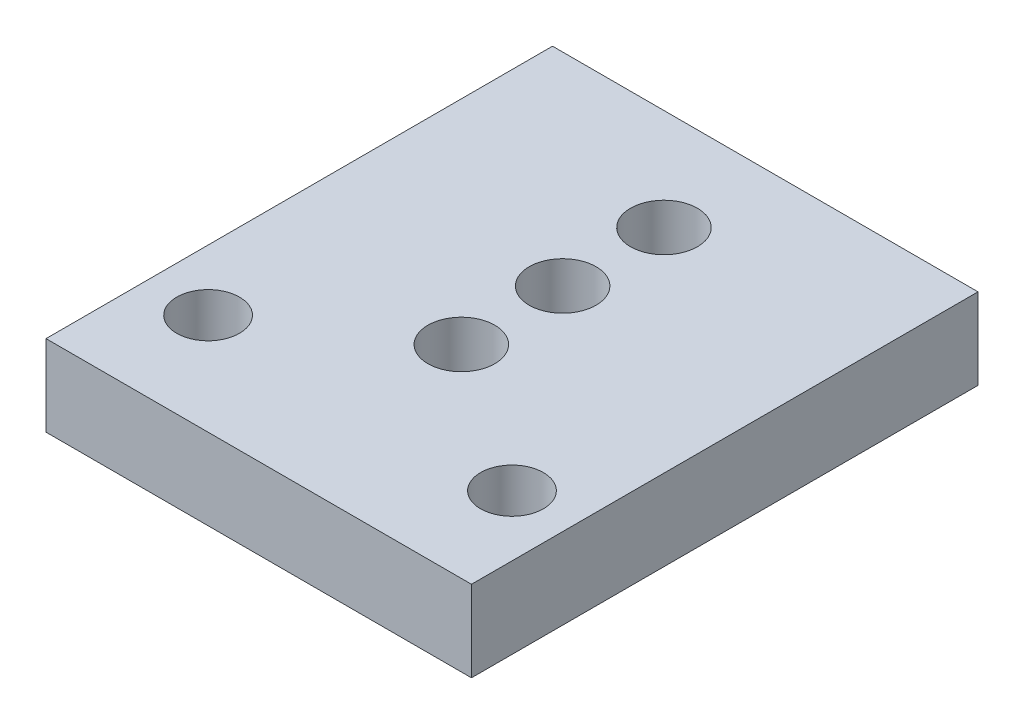
ISO-10303-21;
HEADER;
FILE_DESCRIPTION(('STEP AP214'),'2;1');
FILE_NAME('part.step','',(''),(''),'','','');
FILE_SCHEMA(('AUTOMOTIVE_DESIGN { 1 0 10303 214 1 1 1 1 }'));
ENDSEC;
DATA;
#1=APPLICATION_CONTEXT('core data for automotive mechanical design processes');
#2=APPLICATION_PROTOCOL_DEFINITION('international standard','automotive_design',2000,#1);
#3=PRODUCT_CONTEXT('',#1,'mechanical');
#4=PRODUCT('Part','Part','',(#3));
#5=PRODUCT_RELATED_PRODUCT_CATEGORY('part','',(#4));
#6=PRODUCT_DEFINITION_FORMATION('','',#4);
#7=PRODUCT_DEFINITION_CONTEXT('part definition',#1,'design');
#8=PRODUCT_DEFINITION('design','',#6,#7);
#9=PRODUCT_DEFINITION_SHAPE('','',#8);
#10=(LENGTH_UNIT() NAMED_UNIT(*) SI_UNIT(.MILLI.,.METRE.));
#11=(NAMED_UNIT(*) PLANE_ANGLE_UNIT() SI_UNIT($,.RADIAN.));
#12=(NAMED_UNIT(*) SI_UNIT($,.STERADIAN.) SOLID_ANGLE_UNIT());
#13=UNCERTAINTY_MEASURE_WITH_UNIT(LENGTH_MEASURE(1.E-05),#10,'distance_accuracy_value','');
#14=(GEOMETRIC_REPRESENTATION_CONTEXT(3) GLOBAL_UNCERTAINTY_ASSIGNED_CONTEXT((#13)) GLOBAL_UNIT_ASSIGNED_CONTEXT((#10,
#11,#12)) REPRESENTATION_CONTEXT('',''));
#15=CARTESIAN_POINT('',(0.,0.,0.));
#16=DIRECTION('',(0.,0.,1.));
#17=DIRECTION('',(1.,0.,0.));
#18=AXIS2_PLACEMENT_3D('',#15,#16,#17);
#19=CARTESIAN_POINT('',(0.,4.,0.));
#20=DIRECTION('',(1.,0.,0.));
#21=DIRECTION('',(0.,0.,-1.));
#22=AXIS2_PLACEMENT_3D('',#19,#20,#21);
#23=PLANE('',#22);
#24=DIRECTION('',(0.,0.,1.));
#25=VECTOR('',#24,1.);
#26=CARTESIAN_POINT('',(0.,0.,0.));
#27=LINE('',#26,#25);
#28=CARTESIAN_POINT('',(0.,0.,-25.));
#29=VERTEX_POINT('',#28);
#30=CARTESIAN_POINT('',(0.,0.,0.));
#31=VERTEX_POINT('',#30);
#32=EDGE_CURVE('E104',#29,#31,#27,.T.);
#33=ORIENTED_EDGE('',*,*,#32,.T.);
#34=DIRECTION('',(0.,-1.,0.));
#35=VECTOR('',#34,1.);
#36=CARTESIAN_POINT('',(0.,4.,0.));
#37=LINE('',#36,#35);
#38=CARTESIAN_POINT('',(0.,4.,0.));
#39=VERTEX_POINT('',#38);
#40=EDGE_CURVE('E11',#39,#31,#37,.T.);
#41=ORIENTED_EDGE('',*,*,#40,.F.);
#42=DIRECTION('',(0.,0.,1.));
#43=VECTOR('',#42,1.);
#44=CARTESIAN_POINT('',(0.,4.,0.));
#45=LINE('',#44,#43);
#46=CARTESIAN_POINT('',(0.,4.,-25.));
#47=VERTEX_POINT('',#46);
#48=EDGE_CURVE('E91',#47,#39,#45,.T.);
#49=ORIENTED_EDGE('',*,*,#48,.F.);
#50=DIRECTION('',(0.,-1.,0.));
#51=VECTOR('',#50,1.);
#52=CARTESIAN_POINT('',(0.,4.,-25.));
#53=LINE('',#52,#51);
#54=EDGE_CURVE('E100',#47,#29,#53,.T.);
#55=ORIENTED_EDGE('',*,*,#54,.T.);
#56=EDGE_LOOP('',(#33,#41,#49,#55));
#57=FACE_BOUND('',#56,.T.);
#58=ADVANCED_FACE('F38',(#57),#23,.F.);
#59=CARTESIAN_POINT('',(0.,4.,0.));
#60=DIRECTION('',(0.,0.,-1.));
#61=DIRECTION('',(-1.,0.,0.));
#62=AXIS2_PLACEMENT_3D('',#59,#60,#61);
#63=PLANE('',#62);
#64=DIRECTION('',(1.,0.,0.));
#65=VECTOR('',#64,1.);
#66=CARTESIAN_POINT('',(0.,0.,0.));
#67=LINE('',#66,#65);
#68=CARTESIAN_POINT('',(21.,0.,0.));
#69=VERTEX_POINT('',#68);
#70=EDGE_CURVE('E95',#31,#69,#67,.T.);
#71=ORIENTED_EDGE('',*,*,#70,.T.);
#72=DIRECTION('',(0.,-1.,0.));
#73=VECTOR('',#72,1.);
#74=CARTESIAN_POINT('',(21.,4.,0.));
#75=LINE('',#74,#73);
#76=CARTESIAN_POINT('',(21.,4.,0.));
#77=VERTEX_POINT('',#76);
#78=EDGE_CURVE('E47',#77,#69,#75,.T.);
#79=ORIENTED_EDGE('',*,*,#78,.F.);
#80=DIRECTION('',(1.,0.,0.));
#81=VECTOR('',#80,1.);
#82=CARTESIAN_POINT('',(0.,4.,0.));
#83=LINE('',#82,#81);
#84=EDGE_CURVE('E86',#39,#77,#83,.T.);
#85=ORIENTED_EDGE('',*,*,#84,.F.);
#86=ORIENTED_EDGE('',*,*,#40,.T.);
#87=EDGE_LOOP('',(#71,#79,#85,#86));
#88=FACE_BOUND('',#87,.T.);
#89=ADVANCED_FACE('F94',(#88),#63,.F.);
#90=CARTESIAN_POINT('',(21.,4.,0.));
#91=DIRECTION('',(-1.,0.,0.));
#92=DIRECTION('',(0.,0.,1.));
#93=AXIS2_PLACEMENT_3D('',#90,#91,#92);
#94=PLANE('',#93);
#95=DIRECTION('',(0.,0.,-1.));
#96=VECTOR('',#95,1.);
#97=CARTESIAN_POINT('',(21.,0.,0.));
#98=LINE('',#97,#96);
#99=CARTESIAN_POINT('',(21.,0.,-25.));
#100=VERTEX_POINT('',#99);
#101=EDGE_CURVE('E73',#69,#100,#98,.T.);
#102=ORIENTED_EDGE('',*,*,#101,.T.);
#103=DIRECTION('',(0.,-1.,0.));
#104=VECTOR('',#103,1.);
#105=CARTESIAN_POINT('',(21.,4.,-25.));
#106=LINE('',#105,#104);
#107=CARTESIAN_POINT('',(21.,4.,-25.));
#108=VERTEX_POINT('',#107);
#109=EDGE_CURVE('E96',#108,#100,#106,.T.);
#110=ORIENTED_EDGE('',*,*,#109,.F.);
#111=DIRECTION('',(0.,0.,-1.));
#112=VECTOR('',#111,1.);
#113=CARTESIAN_POINT('',(21.,4.,0.));
#114=LINE('',#113,#112);
#115=EDGE_CURVE('E89',#77,#108,#114,.T.);
#116=ORIENTED_EDGE('',*,*,#115,.F.);
#117=ORIENTED_EDGE('',*,*,#78,.T.);
#118=EDGE_LOOP('',(#102,#110,#116,#117));
#119=FACE_BOUND('',#118,.T.);
#120=ADVANCED_FACE('F98',(#119),#94,.F.);
#121=CARTESIAN_POINT('',(0.,4.,-25.));
#122=DIRECTION('',(0.,0.,1.));
#123=DIRECTION('',(1.,0.,0.));
#124=AXIS2_PLACEMENT_3D('',#121,#122,#123);
#125=PLANE('',#124);
#126=DIRECTION('',(-1.,0.,0.));
#127=VECTOR('',#126,1.);
#128=CARTESIAN_POINT('',(0.,0.,-25.));
#129=LINE('',#128,#127);
#130=EDGE_CURVE('E79',#100,#29,#129,.T.);
#131=ORIENTED_EDGE('',*,*,#130,.T.);
#132=ORIENTED_EDGE('',*,*,#54,.F.);
#133=DIRECTION('',(-1.,0.,0.));
#134=VECTOR('',#133,1.);
#135=CARTESIAN_POINT('',(0.,4.,-25.));
#136=LINE('',#135,#134);
#137=EDGE_CURVE('E56',#108,#47,#136,.T.);
#138=ORIENTED_EDGE('',*,*,#137,.F.);
#139=ORIENTED_EDGE('',*,*,#109,.T.);
#140=EDGE_LOOP('',(#131,#132,#138,#139));
#141=FACE_BOUND('',#140,.T.);
#142=ADVANCED_FACE('F149',(#141),#125,.F.);
#143=CARTESIAN_POINT('',(0.,4.,0.));
#144=DIRECTION('',(0.,-1.,0.));
#145=DIRECTION('',(0.,0.,-1.));
#146=AXIS2_PLACEMENT_3D('',#143,#144,#145);
#147=PLANE('',#146);
#148=CARTESIAN_POINT('',(10.5,4.,-20.));
#149=DIRECTION('',(0.,1.,0.));
#150=DIRECTION('',(0.,0.,1.));
#151=AXIS2_PLACEMENT_3D('',#148,#149,#150);
#152=CIRCLE('',#151,1.65);
#153=CARTESIAN_POINT('',(10.5,4.,-18.35));
#154=VERTEX_POINT('',#153);
#155=EDGE_CURVE('E140',#154,#154,#152,.T.);
#156=ORIENTED_EDGE('',*,*,#155,.F.);
#157=EDGE_LOOP('',(#156));
#158=FACE_BOUND('',#157,.T.);
#159=CARTESIAN_POINT('',(10.5,4.,-15.));
#160=DIRECTION('',(0.,1.,0.));
#161=DIRECTION('',(0.,0.,1.));
#162=AXIS2_PLACEMENT_3D('',#159,#160,#161);
#163=CIRCLE('',#162,1.65);
#164=CARTESIAN_POINT('',(10.5,4.,-13.35));
#165=VERTEX_POINT('',#164);
#166=EDGE_CURVE('E134',#165,#165,#163,.T.);
#167=ORIENTED_EDGE('',*,*,#166,.F.);
#168=EDGE_LOOP('',(#167));
#169=FACE_BOUND('',#168,.T.);
#170=CARTESIAN_POINT('',(10.5,4.,-10.));
#171=DIRECTION('',(0.,1.,0.));
#172=DIRECTION('',(0.,0.,1.));
#173=AXIS2_PLACEMENT_3D('',#170,#171,#172);
#174=CIRCLE('',#173,1.65);
#175=CARTESIAN_POINT('',(10.5,4.,-8.35));
#176=VERTEX_POINT('',#175);
#177=EDGE_CURVE('E128',#176,#176,#174,.T.);
#178=ORIENTED_EDGE('',*,*,#177,.F.);
#179=EDGE_LOOP('',(#178));
#180=FACE_BOUND('',#179,.T.);
#181=CARTESIAN_POINT('',(3.,4.,-5.));
#182=DIRECTION('',(0.,1.,0.));
#183=DIRECTION('',(0.,0.,1.));
#184=AXIS2_PLACEMENT_3D('',#181,#182,#183);
#185=CIRCLE('',#184,1.55);
#186=CARTESIAN_POINT('',(3.,4.,-3.45));
#187=VERTEX_POINT('',#186);
#188=EDGE_CURVE('E121',#187,#187,#185,.T.);
#189=ORIENTED_EDGE('',*,*,#188,.F.);
#190=EDGE_LOOP('',(#189));
#191=FACE_BOUND('',#190,.T.);
#192=CARTESIAN_POINT('',(18.,4.,-5.));
#193=DIRECTION('',(0.,1.,0.));
#194=DIRECTION('',(0.,0.,1.));
#195=AXIS2_PLACEMENT_3D('',#192,#193,#194);
#196=CIRCLE('',#195,1.55);
#197=CARTESIAN_POINT('',(18.,4.,-3.45));
#198=VERTEX_POINT('',#197);
#199=EDGE_CURVE('E113',#198,#198,#196,.T.);
#200=ORIENTED_EDGE('',*,*,#199,.F.);
#201=EDGE_LOOP('',(#200));
#202=FACE_BOUND('',#201,.T.);
#203=ORIENTED_EDGE('',*,*,#48,.T.);
#204=ORIENTED_EDGE('',*,*,#84,.T.);
#205=ORIENTED_EDGE('',*,*,#115,.T.);
#206=ORIENTED_EDGE('',*,*,#137,.T.);
#207=EDGE_LOOP('',(#203,#204,#205,#206));
#208=FACE_BOUND('',#207,.T.);
#209=ADVANCED_FACE('F87',(#158,#169,#180,#191,#202,#208),#147,.F.);
#210=CARTESIAN_POINT('',(0.,0.,0.));
#211=DIRECTION('',(0.,-1.,0.));
#212=DIRECTION('',(0.,0.,-1.));
#213=AXIS2_PLACEMENT_3D('',#210,#211,#212);
#214=PLANE('',#213);
#215=CARTESIAN_POINT('',(10.5,0.,-20.));
#216=DIRECTION('',(0.,1.,0.));
#217=DIRECTION('',(0.,0.,1.));
#218=AXIS2_PLACEMENT_3D('',#215,#216,#217);
#219=CIRCLE('',#218,1.65);
#220=CARTESIAN_POINT('',(10.5,0.,-18.35));
#221=VERTEX_POINT('',#220);
#222=EDGE_CURVE('E137',#221,#221,#219,.T.);
#223=ORIENTED_EDGE('',*,*,#222,.T.);
#224=EDGE_LOOP('',(#223));
#225=FACE_BOUND('',#224,.T.);
#226=CARTESIAN_POINT('',(10.5,0.,-15.));
#227=DIRECTION('',(0.,1.,0.));
#228=DIRECTION('',(0.,0.,1.));
#229=AXIS2_PLACEMENT_3D('',#226,#227,#228);
#230=CIRCLE('',#229,1.65);
#231=CARTESIAN_POINT('',(10.5,0.,-13.35));
#232=VERTEX_POINT('',#231);
#233=EDGE_CURVE('E131',#232,#232,#230,.T.);
#234=ORIENTED_EDGE('',*,*,#233,.T.);
#235=EDGE_LOOP('',(#234));
#236=FACE_BOUND('',#235,.T.);
#237=CARTESIAN_POINT('',(10.5,0.,-10.));
#238=DIRECTION('',(0.,1.,0.));
#239=DIRECTION('',(0.,0.,1.));
#240=AXIS2_PLACEMENT_3D('',#237,#238,#239);
#241=CIRCLE('',#240,1.65);
#242=CARTESIAN_POINT('',(10.5,0.,-8.35));
#243=VERTEX_POINT('',#242);
#244=EDGE_CURVE('E125',#243,#243,#241,.T.);
#245=ORIENTED_EDGE('',*,*,#244,.T.);
#246=EDGE_LOOP('',(#245));
#247=FACE_BOUND('',#246,.T.);
#248=CARTESIAN_POINT('',(3.,0.,-5.));
#249=DIRECTION('',(0.,-1.,0.));
#250=DIRECTION('',(0.,0.,-1.));
#251=AXIS2_PLACEMENT_3D('',#248,#249,#250);
#252=CIRCLE('',#251,1.55);
#253=CARTESIAN_POINT('',(3.,0.,-6.55));
#254=VERTEX_POINT('',#253);
#255=EDGE_CURVE('E41',#254,#254,#252,.T.);
#256=ORIENTED_EDGE('',*,*,#255,.F.);
#257=EDGE_LOOP('',(#256));
#258=FACE_BOUND('',#257,.T.);
#259=CARTESIAN_POINT('',(18.,0.,-5.));
#260=DIRECTION('',(0.,-1.,0.));
#261=DIRECTION('',(0.,0.,-1.));
#262=AXIS2_PLACEMENT_3D('',#259,#260,#261);
#263=CIRCLE('',#262,1.55);
#264=CARTESIAN_POINT('',(18.,0.,-6.55));
#265=VERTEX_POINT('',#264);
#266=EDGE_CURVE('E107',#265,#265,#263,.T.);
#267=ORIENTED_EDGE('',*,*,#266,.F.);
#268=EDGE_LOOP('',(#267));
#269=FACE_BOUND('',#268,.T.);
#270=ORIENTED_EDGE('',*,*,#32,.F.);
#271=ORIENTED_EDGE('',*,*,#130,.F.);
#272=ORIENTED_EDGE('',*,*,#101,.F.);
#273=ORIENTED_EDGE('',*,*,#70,.F.);
#274=EDGE_LOOP('',(#270,#271,#272,#273));
#275=FACE_BOUND('',#274,.T.);
#276=ADVANCED_FACE('F148',(#225,#236,#247,#258,#269,#275),#214,.T.);
#277=CARTESIAN_POINT('',(18.,4.,-5.));
#278=DIRECTION('',(0.,1.,0.));
#279=DIRECTION('',(0.,0.,1.));
#280=AXIS2_PLACEMENT_3D('',#277,#278,#279);
#281=CYLINDRICAL_SURFACE('',#280,1.55);
#282=ORIENTED_EDGE('',*,*,#266,.T.);
#283=EDGE_LOOP('',(#282));
#284=FACE_BOUND('',#283,.T.);
#285=ORIENTED_EDGE('',*,*,#199,.T.);
#286=EDGE_LOOP('',(#285));
#287=FACE_BOUND('',#286,.T.);
#288=ADVANCED_FACE('F161',(#284,#287),#281,.F.);
#289=CARTESIAN_POINT('',(3.,4.,-5.));
#290=DIRECTION('',(0.,1.,0.));
#291=DIRECTION('',(0.,0.,1.));
#292=AXIS2_PLACEMENT_3D('',#289,#290,#291);
#293=CYLINDRICAL_SURFACE('',#292,1.55);
#294=ORIENTED_EDGE('',*,*,#255,.T.);
#295=EDGE_LOOP('',(#294));
#296=FACE_BOUND('',#295,.T.);
#297=ORIENTED_EDGE('',*,*,#188,.T.);
#298=EDGE_LOOP('',(#297));
#299=FACE_BOUND('',#298,.T.);
#300=ADVANCED_FACE('F158',(#296,#299),#293,.F.);
#301=CARTESIAN_POINT('',(10.5,4.,-10.));
#302=DIRECTION('',(0.,1.,0.));
#303=DIRECTION('',(0.,0.,1.));
#304=AXIS2_PLACEMENT_3D('',#301,#302,#303);
#305=CYLINDRICAL_SURFACE('',#304,1.65);
#306=ORIENTED_EDGE('',*,*,#244,.F.);
#307=EDGE_LOOP('',(#306));
#308=FACE_BOUND('',#307,.T.);
#309=ORIENTED_EDGE('',*,*,#177,.T.);
#310=EDGE_LOOP('',(#309));
#311=FACE_BOUND('',#310,.T.);
#312=ADVANCED_FACE('F160',(#308,#311),#305,.F.);
#313=CARTESIAN_POINT('',(10.5,4.,-15.));
#314=DIRECTION('',(0.,1.,0.));
#315=DIRECTION('',(0.,0.,1.));
#316=AXIS2_PLACEMENT_3D('',#313,#314,#315);
#317=CYLINDRICAL_SURFACE('',#316,1.65);
#318=ORIENTED_EDGE('',*,*,#233,.F.);
#319=EDGE_LOOP('',(#318));
#320=FACE_BOUND('',#319,.T.);
#321=ORIENTED_EDGE('',*,*,#166,.T.);
#322=EDGE_LOOP('',(#321));
#323=FACE_BOUND('',#322,.T.);
#324=ADVANCED_FACE('F168',(#320,#323),#317,.F.);
#325=CARTESIAN_POINT('',(10.5,4.,-20.));
#326=DIRECTION('',(0.,1.,0.));
#327=DIRECTION('',(0.,0.,1.));
#328=AXIS2_PLACEMENT_3D('',#325,#326,#327);
#329=CYLINDRICAL_SURFACE('',#328,1.65);
#330=ORIENTED_EDGE('',*,*,#222,.F.);
#331=EDGE_LOOP('',(#330));
#332=FACE_BOUND('',#331,.T.);
#333=ORIENTED_EDGE('',*,*,#155,.T.);
#334=EDGE_LOOP('',(#333));
#335=FACE_BOUND('',#334,.T.);
#336=ADVANCED_FACE('F144',(#332,#335),#329,.F.);
#337=CLOSED_SHELL('',(#58,#89,#120,#142,#209,#276,#288,#300,#312,#324,#336));
#338=MANIFOLD_SOLID_BREP('B2',#337);
#339=ADVANCED_BREP_SHAPE_REPRESENTATION('',(#18,#338),#14);
#340=SHAPE_DEFINITION_REPRESENTATION(#9,#339);
ENDSEC;
END-ISO-10303-21;
